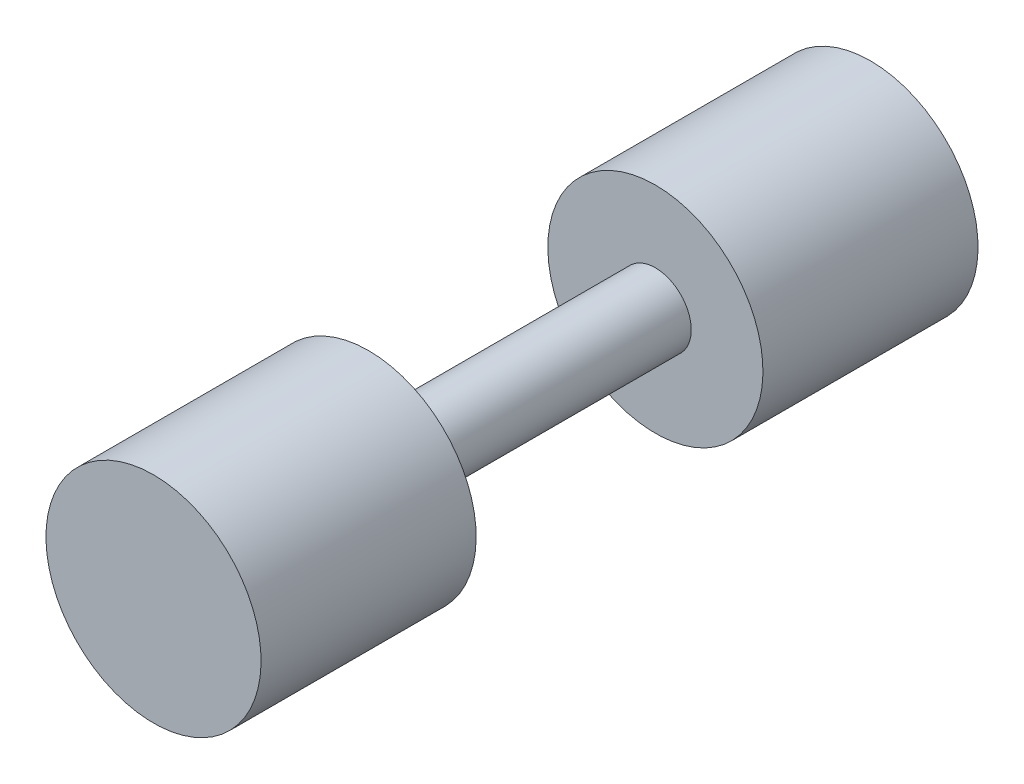
ISO-10303-21;
HEADER;
FILE_DESCRIPTION(('STEP AP214'),'2;1');
FILE_NAME('part.step','',(''),(''),'','','');
FILE_SCHEMA(('AUTOMOTIVE_DESIGN { 1 0 10303 214 1 1 1 1 }'));
ENDSEC;
DATA;
#1=APPLICATION_CONTEXT('core data for automotive mechanical design processes');
#2=APPLICATION_PROTOCOL_DEFINITION('international standard','automotive_design',2000,#1);
#3=PRODUCT_CONTEXT('',#1,'mechanical');
#4=PRODUCT('Part','Part','',(#3));
#5=PRODUCT_RELATED_PRODUCT_CATEGORY('part','',(#4));
#6=PRODUCT_DEFINITION_FORMATION('','',#4);
#7=PRODUCT_DEFINITION_CONTEXT('part definition',#1,'design');
#8=PRODUCT_DEFINITION('design','',#6,#7);
#9=PRODUCT_DEFINITION_SHAPE('','',#8);
#10=(LENGTH_UNIT() NAMED_UNIT(*) SI_UNIT(.MILLI.,.METRE.));
#11=(NAMED_UNIT(*) PLANE_ANGLE_UNIT() SI_UNIT($,.RADIAN.));
#12=(NAMED_UNIT(*) SI_UNIT($,.STERADIAN.) SOLID_ANGLE_UNIT());
#13=UNCERTAINTY_MEASURE_WITH_UNIT(LENGTH_MEASURE(1.E-05),#10,'distance_accuracy_value','');
#14=(GEOMETRIC_REPRESENTATION_CONTEXT(3) GLOBAL_UNCERTAINTY_ASSIGNED_CONTEXT((#13)) GLOBAL_UNIT_ASSIGNED_CONTEXT((#10,
#11,#12)) REPRESENTATION_CONTEXT('',''));
#15=CARTESIAN_POINT('',(0.,0.,0.));
#16=DIRECTION('',(0.,0.,1.));
#17=DIRECTION('',(1.,0.,0.));
#18=AXIS2_PLACEMENT_3D('',#15,#16,#17);
#19=CARTESIAN_POINT('',(0.,0.,-63.5));
#20=DIRECTION('',(0.,0.,-1.));
#21=DIRECTION('',(0.,1.,0.));
#22=AXIS2_PLACEMENT_3D('',#19,#20,#21);
#23=CYLINDRICAL_SURFACE('',#22,19.05);
#24=CARTESIAN_POINT('',(0.,0.,-25.4));
#25=DIRECTION('',(0.,0.,-1.));
#26=DIRECTION('',(0.,1.,0.));
#27=AXIS2_PLACEMENT_3D('',#24,#25,#26);
#28=CIRCLE('',#27,19.05);
#29=CARTESIAN_POINT('',(0.,19.05,-25.4));
#30=VERTEX_POINT('',#29);
#31=EDGE_CURVE('E55',#30,#30,#28,.T.);
#32=ORIENTED_EDGE('',*,*,#31,.T.);
#33=EDGE_LOOP('',(#32));
#34=FACE_BOUND('',#33,.T.);
#35=CARTESIAN_POINT('',(0.,0.,-63.5));
#36=DIRECTION('',(0.,0.,-1.));
#37=DIRECTION('',(0.,1.,0.));
#38=AXIS2_PLACEMENT_3D('',#35,#36,#37);
#39=CIRCLE('',#38,19.05);
#40=CARTESIAN_POINT('',(0.,19.05,-63.5));
#41=VERTEX_POINT('',#40);
#42=EDGE_CURVE('E10',#41,#41,#39,.T.);
#43=ORIENTED_EDGE('',*,*,#42,.F.);
#44=EDGE_LOOP('',(#43));
#45=FACE_BOUND('',#44,.T.);
#46=ADVANCED_FACE('F33',(#34,#45),#23,.T.);
#47=CARTESIAN_POINT('',(0.,19.05,-63.5));
#48=DIRECTION('',(0.,0.,-1.));
#49=DIRECTION('',(0.,1.,0.));
#50=AXIS2_PLACEMENT_3D('',#47,#48,#49);
#51=PLANE('',#50);
#52=ORIENTED_EDGE('',*,*,#42,.T.);
#53=EDGE_LOOP('',(#52));
#54=FACE_BOUND('',#53,.T.);
#55=ADVANCED_FACE('F73',(#54),#51,.T.);
#56=CARTESIAN_POINT('',(0.,0.,63.5));
#57=DIRECTION('',(0.,0.,1.));
#58=DIRECTION('',(0.,-1.,0.));
#59=AXIS2_PLACEMENT_3D('',#56,#57,#58);
#60=PLANE('',#59);
#61=CARTESIAN_POINT('',(0.,0.,63.5));
#62=DIRECTION('',(0.,0.,-1.));
#63=DIRECTION('',(0.,1.,0.));
#64=AXIS2_PLACEMENT_3D('',#61,#62,#63);
#65=CIRCLE('',#64,19.05);
#66=CARTESIAN_POINT('',(0.,19.05,63.5));
#67=VERTEX_POINT('',#66);
#68=EDGE_CURVE('E39',#67,#67,#65,.T.);
#69=ORIENTED_EDGE('',*,*,#68,.F.);
#70=EDGE_LOOP('',(#69));
#71=FACE_BOUND('',#70,.T.);
#72=ADVANCED_FACE('F77',(#71),#60,.T.);
#73=CARTESIAN_POINT('',(0.,0.,-63.5));
#74=DIRECTION('',(0.,0.,-1.));
#75=DIRECTION('',(0.,1.,0.));
#76=AXIS2_PLACEMENT_3D('',#73,#74,#75);
#77=CYLINDRICAL_SURFACE('',#76,19.05);
#78=ORIENTED_EDGE('',*,*,#68,.T.);
#79=EDGE_LOOP('',(#78));
#80=FACE_BOUND('',#79,.T.);
#81=CARTESIAN_POINT('',(0.,0.,25.4));
#82=DIRECTION('',(0.,0.,-1.));
#83=DIRECTION('',(0.,1.,0.));
#84=AXIS2_PLACEMENT_3D('',#81,#82,#83);
#85=CIRCLE('',#84,19.05);
#86=CARTESIAN_POINT('',(0.,19.05,25.4));
#87=VERTEX_POINT('',#86);
#88=EDGE_CURVE('E43',#87,#87,#85,.T.);
#89=ORIENTED_EDGE('',*,*,#88,.F.);
#90=EDGE_LOOP('',(#89));
#91=FACE_BOUND('',#90,.T.);
#92=ADVANCED_FACE('F81',(#80,#91),#77,.T.);
#93=CARTESIAN_POINT('',(0.,19.05,25.4));
#94=DIRECTION('',(0.,0.,-1.));
#95=DIRECTION('',(0.,1.,0.));
#96=AXIS2_PLACEMENT_3D('',#93,#94,#95);
#97=PLANE('',#96);
#98=ORIENTED_EDGE('',*,*,#88,.T.);
#99=EDGE_LOOP('',(#98));
#100=FACE_BOUND('',#99,.T.);
#101=CARTESIAN_POINT('',(0.,0.,25.4));
#102=DIRECTION('',(0.,0.,-1.));
#103=DIRECTION('',(0.,1.,0.));
#104=AXIS2_PLACEMENT_3D('',#101,#102,#103);
#105=CIRCLE('',#104,6.35000000000001);
#106=CARTESIAN_POINT('',(0.,6.34999999999999,25.4));
#107=VERTEX_POINT('',#106);
#108=EDGE_CURVE('E47',#107,#107,#105,.T.);
#109=ORIENTED_EDGE('',*,*,#108,.F.);
#110=EDGE_LOOP('',(#109));
#111=FACE_BOUND('',#110,.T.);
#112=ADVANCED_FACE('F69',(#100,#111),#97,.T.);
#113=CARTESIAN_POINT('',(0.,0.,-63.5));
#114=DIRECTION('',(0.,0.,-1.));
#115=DIRECTION('',(0.,1.,0.));
#116=AXIS2_PLACEMENT_3D('',#113,#114,#115);
#117=CYLINDRICAL_SURFACE('',#116,6.35000000000001);
#118=ORIENTED_EDGE('',*,*,#108,.T.);
#119=EDGE_LOOP('',(#118));
#120=FACE_BOUND('',#119,.T.);
#121=CARTESIAN_POINT('',(0.,0.,-25.4));
#122=DIRECTION('',(0.,0.,-1.));
#123=DIRECTION('',(0.,1.,0.));
#124=AXIS2_PLACEMENT_3D('',#121,#122,#123);
#125=CIRCLE('',#124,6.35000000000001);
#126=CARTESIAN_POINT('',(0.,6.34999999999999,-25.4));
#127=VERTEX_POINT('',#126);
#128=EDGE_CURVE('E52',#127,#127,#125,.T.);
#129=ORIENTED_EDGE('',*,*,#128,.F.);
#130=EDGE_LOOP('',(#129));
#131=FACE_BOUND('',#130,.T.);
#132=ADVANCED_FACE('F63',(#120,#131),#117,.T.);
#133=CARTESIAN_POINT('',(0.,6.34999999999999,-25.4));
#134=DIRECTION('',(0.,0.,1.));
#135=DIRECTION('',(0.,-1.,0.));
#136=AXIS2_PLACEMENT_3D('',#133,#134,#135);
#137=PLANE('',#136);
#138=ORIENTED_EDGE('',*,*,#128,.T.);
#139=EDGE_LOOP('',(#138));
#140=FACE_BOUND('',#139,.T.);
#141=ORIENTED_EDGE('',*,*,#31,.F.);
#142=EDGE_LOOP('',(#141));
#143=FACE_BOUND('',#142,.T.);
#144=ADVANCED_FACE('F61',(#140,#143),#137,.T.);
#145=CLOSED_SHELL('',(#46,#55,#72,#92,#112,#132,#144));
#146=MANIFOLD_SOLID_BREP('B2',#145);
#147=ADVANCED_BREP_SHAPE_REPRESENTATION('',(#18,#146),#14);
#148=SHAPE_DEFINITION_REPRESENTATION(#9,#147);
ENDSEC;
END-ISO-10303-21;
